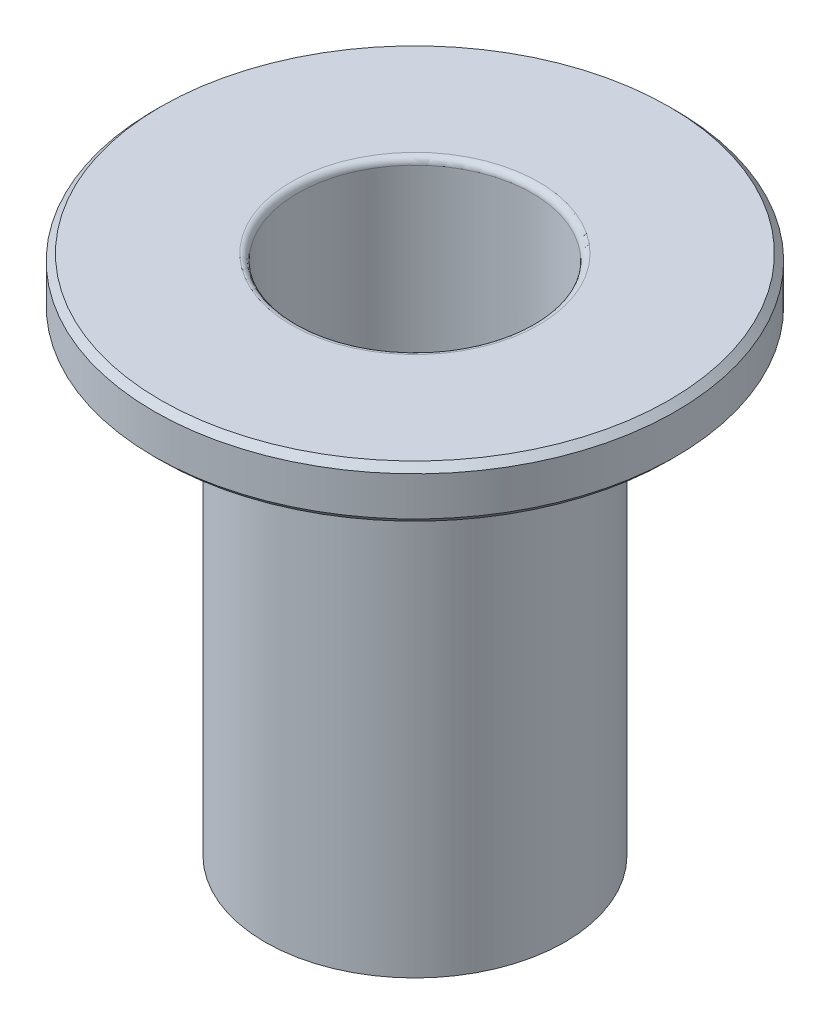
ISO-10303-21;
HEADER;
FILE_DESCRIPTION(('STEP AP214'),'2;1');
FILE_NAME('part.step','',(''),(''),'','','');
FILE_SCHEMA(('AUTOMOTIVE_DESIGN { 1 0 10303 214 1 1 1 1 }'));
ENDSEC;
DATA;
#1=APPLICATION_CONTEXT('core data for automotive mechanical design processes');
#2=APPLICATION_PROTOCOL_DEFINITION('international standard','automotive_design',2000,#1);
#3=PRODUCT_CONTEXT('',#1,'mechanical');
#4=PRODUCT('Part','Part','',(#3));
#5=PRODUCT_RELATED_PRODUCT_CATEGORY('part','',(#4));
#6=PRODUCT_DEFINITION_FORMATION('','',#4);
#7=PRODUCT_DEFINITION_CONTEXT('part definition',#1,'design');
#8=PRODUCT_DEFINITION('design','',#6,#7);
#9=PRODUCT_DEFINITION_SHAPE('','',#8);
#10=(LENGTH_UNIT() NAMED_UNIT(*) SI_UNIT(.MILLI.,.METRE.));
#11=(NAMED_UNIT(*) PLANE_ANGLE_UNIT() SI_UNIT($,.RADIAN.));
#12=(NAMED_UNIT(*) SI_UNIT($,.STERADIAN.) SOLID_ANGLE_UNIT());
#13=UNCERTAINTY_MEASURE_WITH_UNIT(LENGTH_MEASURE(1.E-05),#10,'distance_accuracy_value','');
#14=(GEOMETRIC_REPRESENTATION_CONTEXT(3) GLOBAL_UNCERTAINTY_ASSIGNED_CONTEXT((#13)) GLOBAL_UNIT_ASSIGNED_CONTEXT((#10,
#11,#12)) REPRESENTATION_CONTEXT('',''));
#15=CARTESIAN_POINT('',(0.,0.,0.));
#16=DIRECTION('',(0.,0.,1.));
#17=DIRECTION('',(1.,0.,0.));
#18=AXIS2_PLACEMENT_3D('',#15,#16,#17);
#19=CARTESIAN_POINT('',(0.,2.,0.));
#20=DIRECTION('',(0.,-1.,0.));
#21=DIRECTION('',(0.,0.,-1.));
#22=AXIS2_PLACEMENT_3D('',#19,#20,#21);
#23=CYLINDRICAL_SURFACE('',#22,10.);
#24=CARTESIAN_POINT('',(0.,0.249999999999999,0.));
#25=DIRECTION('',(0.,1.,0.));
#26=DIRECTION('',(0.,0.,1.));
#27=AXIS2_PLACEMENT_3D('',#24,#25,#26);
#28=CIRCLE('',#27,10.);
#29=CARTESIAN_POINT('',(0.,0.249999999999999,10.));
#30=VERTEX_POINT('',#29);
#31=EDGE_CURVE('E57',#30,#30,#28,.T.);
#32=ORIENTED_EDGE('',*,*,#31,.T.);
#33=EDGE_LOOP('',(#32));
#34=FACE_BOUND('',#33,.T.);
#35=CARTESIAN_POINT('',(0.,1.74999999999999,0.));
#36=DIRECTION('',(0.,1.,0.));
#37=DIRECTION('',(0.,0.,1.));
#38=AXIS2_PLACEMENT_3D('',#35,#36,#37);
#39=CIRCLE('',#38,10.);
#40=CARTESIAN_POINT('',(0.,1.74999999999999,10.));
#41=VERTEX_POINT('',#40);
#42=EDGE_CURVE('E60',#41,#41,#39,.F.);
#43=ORIENTED_EDGE('',*,*,#42,.T.);
#44=EDGE_LOOP('',(#43));
#45=FACE_BOUND('',#44,.T.);
#46=ADVANCED_FACE('F31',(#34,#45),#23,.T.);
#47=CARTESIAN_POINT('',(0.,2.,0.));
#48=DIRECTION('',(0.,1.,0.));
#49=DIRECTION('',(0.,0.,1.));
#50=AXIS2_PLACEMENT_3D('',#47,#48,#49);
#51=PLANE('',#50);
#52=CARTESIAN_POINT('',(0.,2.,0.));
#53=DIRECTION('',(0.,1.,0.));
#54=DIRECTION('',(0.,0.,1.));
#55=AXIS2_PLACEMENT_3D('',#52,#53,#54);
#56=CIRCLE('',#55,4.75);
#57=CARTESIAN_POINT('',(0.,2.,4.75));
#58=VERTEX_POINT('',#57);
#59=EDGE_CURVE('E10',#58,#58,#56,.F.);
#60=ORIENTED_EDGE('',*,*,#59,.T.);
#61=EDGE_LOOP('',(#60));
#62=FACE_BOUND('',#61,.T.);
#63=CARTESIAN_POINT('',(0.,2.,0.));
#64=DIRECTION('',(0.,1.,0.));
#65=DIRECTION('',(0.,0.,1.));
#66=AXIS2_PLACEMENT_3D('',#63,#64,#65);
#67=CIRCLE('',#66,9.75);
#68=CARTESIAN_POINT('',(0.,2.,9.75));
#69=VERTEX_POINT('',#68);
#70=EDGE_CURVE('E51',#69,#69,#67,.T.);
#71=ORIENTED_EDGE('',*,*,#70,.T.);
#72=EDGE_LOOP('',(#71));
#73=FACE_BOUND('',#72,.T.);
#74=ADVANCED_FACE('F80',(#62,#73),#51,.T.);
#75=CARTESIAN_POINT('',(0.,0.,0.));
#76=DIRECTION('',(0.,1.,0.));
#77=DIRECTION('',(0.,0.,1.));
#78=AXIS2_PLACEMENT_3D('',#75,#76,#77);
#79=PLANE('',#78);
#80=CARTESIAN_POINT('',(0.,0.,0.));
#81=DIRECTION('',(0.,1.,0.));
#82=DIRECTION('',(0.,0.,1.));
#83=AXIS2_PLACEMENT_3D('',#80,#81,#82);
#84=CIRCLE('',#83,9.75);
#85=CARTESIAN_POINT('',(0.,0.,9.75));
#86=VERTEX_POINT('',#85);
#87=EDGE_CURVE('E54',#86,#86,#84,.F.);
#88=ORIENTED_EDGE('',*,*,#87,.T.);
#89=EDGE_LOOP('',(#88));
#90=FACE_BOUND('',#89,.T.);
#91=CARTESIAN_POINT('',(0.,0.,0.));
#92=DIRECTION('',(0.,1.,0.));
#93=DIRECTION('',(0.,0.,1.));
#94=AXIS2_PLACEMENT_3D('',#91,#92,#93);
#95=CIRCLE('',#94,5.75);
#96=CARTESIAN_POINT('',(0.,0.,5.75));
#97=VERTEX_POINT('',#96);
#98=EDGE_CURVE('E63',#97,#97,#95,.F.);
#99=ORIENTED_EDGE('',*,*,#98,.F.);
#100=EDGE_LOOP('',(#99));
#101=FACE_BOUND('',#100,.T.);
#102=ADVANCED_FACE('F75',(#90,#101),#79,.F.);
#103=CARTESIAN_POINT('',(0.,-18.,0.));
#104=DIRECTION('',(0.,1.,0.));
#105=DIRECTION('',(0.,0.,1.));
#106=AXIS2_PLACEMENT_3D('',#103,#104,#105);
#107=CYLINDRICAL_SURFACE('',#106,5.75);
#108=CARTESIAN_POINT('',(0.,-18.,0.));
#109=DIRECTION('',(0.,-1.,0.));
#110=DIRECTION('',(0.,0.,-1.));
#111=AXIS2_PLACEMENT_3D('',#108,#109,#110);
#112=CIRCLE('',#111,5.75);
#113=CARTESIAN_POINT('',(0.,-18.,-5.75));
#114=VERTEX_POINT('',#113);
#115=EDGE_CURVE('E66',#114,#114,#112,.T.);
#116=ORIENTED_EDGE('',*,*,#115,.F.);
#117=EDGE_LOOP('',(#116));
#118=FACE_BOUND('',#117,.T.);
#119=ORIENTED_EDGE('',*,*,#98,.T.);
#120=EDGE_LOOP('',(#119));
#121=FACE_BOUND('',#120,.T.);
#122=ADVANCED_FACE('F72',(#118,#121),#107,.T.);
#123=CARTESIAN_POINT('',(0.,-18.,0.));
#124=DIRECTION('',(0.,-1.,0.));
#125=DIRECTION('',(0.,0.,-1.));
#126=AXIS2_PLACEMENT_3D('',#123,#124,#125);
#127=PLANE('',#126);
#128=CARTESIAN_POINT('',(0.,-18.,0.));
#129=DIRECTION('',(0.,-1.,0.));
#130=DIRECTION('',(0.,0.,-1.));
#131=AXIS2_PLACEMENT_3D('',#128,#129,#130);
#132=CIRCLE('',#131,4.75);
#133=CARTESIAN_POINT('',(0.,-18.,-4.75));
#134=VERTEX_POINT('',#133);
#135=EDGE_CURVE('E46',#134,#134,#132,.F.);
#136=ORIENTED_EDGE('',*,*,#135,.T.);
#137=EDGE_LOOP('',(#136));
#138=FACE_BOUND('',#137,.T.);
#139=ORIENTED_EDGE('',*,*,#115,.T.);
#140=EDGE_LOOP('',(#139));
#141=FACE_BOUND('',#140,.T.);
#142=ADVANCED_FACE('F70',(#138,#141),#127,.T.);
#143=CARTESIAN_POINT('',(0.,-18.001,0.));
#144=DIRECTION('',(0.,1.,0.));
#145=DIRECTION('',(0.,0.,1.));
#146=AXIS2_PLACEMENT_3D('',#143,#144,#145);
#147=CYLINDRICAL_SURFACE('',#146,4.5);
#148=CARTESIAN_POINT('',(0.,-17.75,0.));
#149=DIRECTION('',(0.,-1.,0.));
#150=DIRECTION('',(0.,0.,-1.));
#151=AXIS2_PLACEMENT_3D('',#148,#149,#150);
#152=CIRCLE('',#151,4.5);
#153=CARTESIAN_POINT('',(0.,-17.75,-4.5));
#154=VERTEX_POINT('',#153);
#155=EDGE_CURVE('E38',#154,#154,#152,.T.);
#156=ORIENTED_EDGE('',*,*,#155,.T.);
#157=EDGE_LOOP('',(#156));
#158=FACE_BOUND('',#157,.T.);
#159=CARTESIAN_POINT('',(0.,1.75,0.));
#160=DIRECTION('',(0.,1.,0.));
#161=DIRECTION('',(0.,0.,1.));
#162=AXIS2_PLACEMENT_3D('',#159,#160,#161);
#163=CIRCLE('',#162,4.5);
#164=CARTESIAN_POINT('',(0.,1.75,4.5));
#165=VERTEX_POINT('',#164);
#166=EDGE_CURVE('E42',#165,#165,#163,.T.);
#167=ORIENTED_EDGE('',*,*,#166,.T.);
#168=EDGE_LOOP('',(#167));
#169=FACE_BOUND('',#168,.T.);
#170=ADVANCED_FACE('F98',(#158,#169),#147,.F.);
#171=CARTESIAN_POINT('',(0.,0.249999999999999,0.));
#172=DIRECTION('',(0.,1.,0.));
#173=DIRECTION('',(0.,0.,1.));
#174=AXIS2_PLACEMENT_3D('',#171,#172,#173);
#175=CONICAL_SURFACE('',#174,10.,0.785398163397455);
#176=ORIENTED_EDGE('',*,*,#87,.F.);
#177=EDGE_LOOP('',(#176));
#178=FACE_BOUND('',#177,.T.);
#179=ORIENTED_EDGE('',*,*,#31,.F.);
#180=EDGE_LOOP('',(#179));
#181=FACE_BOUND('',#180,.T.);
#182=ADVANCED_FACE('F94',(#178,#181),#175,.T.);
#183=CARTESIAN_POINT('',(0.,2.,0.));
#184=DIRECTION('',(0.,-1.,0.));
#185=DIRECTION('',(0.,0.,-1.));
#186=AXIS2_PLACEMENT_3D('',#183,#184,#185);
#187=CONICAL_SURFACE('',#186,9.75,0.785398163397434);
#188=ORIENTED_EDGE('',*,*,#42,.F.);
#189=EDGE_LOOP('',(#188));
#190=FACE_BOUND('',#189,.T.);
#191=ORIENTED_EDGE('',*,*,#70,.F.);
#192=EDGE_LOOP('',(#191));
#193=FACE_BOUND('',#192,.T.);
#194=ADVANCED_FACE('F97',(#190,#193),#187,.T.);
#195=CARTESIAN_POINT('',(0.,-17.75,0.));
#196=DIRECTION('',(0.,-1.,0.));
#197=DIRECTION('',(0.,0.,-1.));
#198=AXIS2_PLACEMENT_3D('',#195,#196,#197);
#199=TOROIDAL_SURFACE('',#198,4.75,0.25);
#200=ORIENTED_EDGE('',*,*,#155,.F.);
#201=EDGE_LOOP('',(#200));
#202=FACE_BOUND('',#201,.T.);
#203=ORIENTED_EDGE('',*,*,#135,.F.);
#204=EDGE_LOOP('',(#203));
#205=FACE_BOUND('',#204,.T.);
#206=ADVANCED_FACE('F101',(#202,#205),#199,.T.);
#207=CARTESIAN_POINT('',(0.,1.75,0.));
#208=DIRECTION('',(0.,1.,0.));
#209=DIRECTION('',(0.,0.,1.));
#210=AXIS2_PLACEMENT_3D('',#207,#208,#209);
#211=TOROIDAL_SURFACE('',#210,4.75,0.25);
#212=ORIENTED_EDGE('',*,*,#59,.F.);
#213=EDGE_LOOP('',(#212));
#214=FACE_BOUND('',#213,.T.);
#215=ORIENTED_EDGE('',*,*,#166,.F.);
#216=EDGE_LOOP('',(#215));
#217=FACE_BOUND('',#216,.T.);
#218=ADVANCED_FACE('F33',(#214,#217),#211,.T.);
#219=CLOSED_SHELL('',(#46,#74,#102,#122,#142,#170,#182,#194,#206,#218));
#220=MANIFOLD_SOLID_BREP('B2',#219);
#221=ADVANCED_BREP_SHAPE_REPRESENTATION('',(#18,#220),#14);
#222=SHAPE_DEFINITION_REPRESENTATION(#9,#221);
ENDSEC;
END-ISO-10303-21;
